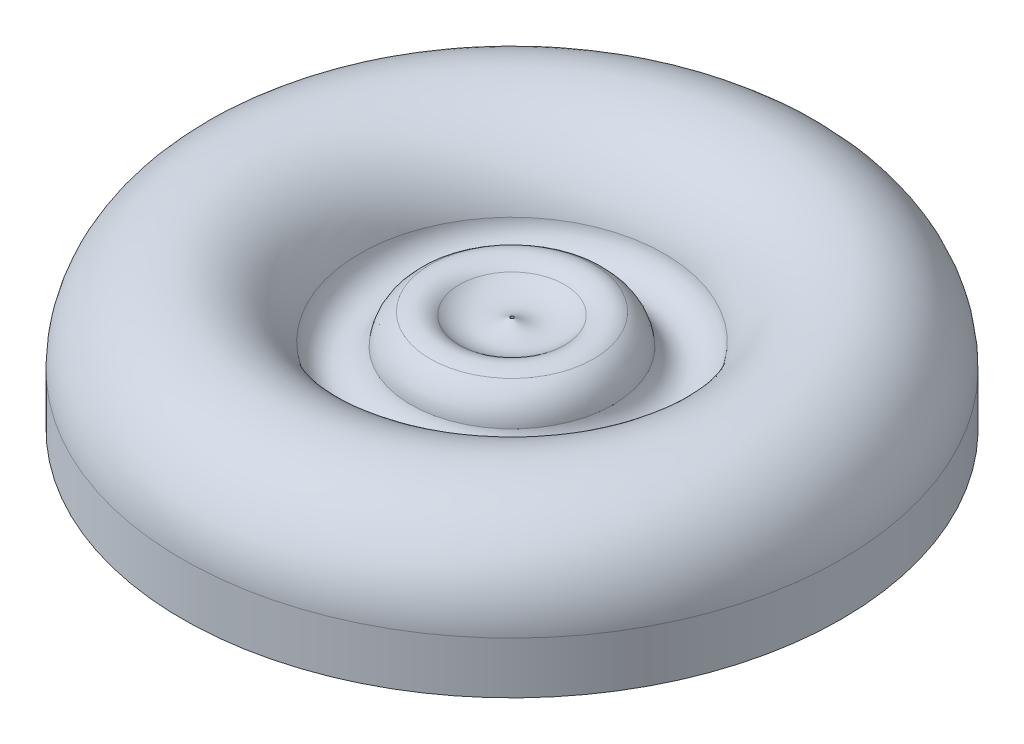
ISO-10303-21;
HEADER;
FILE_DESCRIPTION(('STEP AP214'),'2;1');
FILE_NAME('part.step','',(''),(''),'','','');
FILE_SCHEMA(('AUTOMOTIVE_DESIGN { 1 0 10303 214 1 1 1 1 }'));
ENDSEC;
DATA;
#1=APPLICATION_CONTEXT('core data for automotive mechanical design processes');
#2=APPLICATION_PROTOCOL_DEFINITION('international standard','automotive_design',2000,#1);
#3=PRODUCT_CONTEXT('',#1,'mechanical');
#4=PRODUCT('Part','Part','',(#3));
#5=PRODUCT_RELATED_PRODUCT_CATEGORY('part','',(#4));
#6=PRODUCT_DEFINITION_FORMATION('','',#4);
#7=PRODUCT_DEFINITION_CONTEXT('part definition',#1,'design');
#8=PRODUCT_DEFINITION('design','',#6,#7);
#9=PRODUCT_DEFINITION_SHAPE('','',#8);
#10=(LENGTH_UNIT() NAMED_UNIT(*) SI_UNIT(.MILLI.,.METRE.));
#11=(NAMED_UNIT(*) PLANE_ANGLE_UNIT() SI_UNIT($,.RADIAN.));
#12=(NAMED_UNIT(*) SI_UNIT($,.STERADIAN.) SOLID_ANGLE_UNIT());
#13=UNCERTAINTY_MEASURE_WITH_UNIT(LENGTH_MEASURE(1.E-05),#10,'distance_accuracy_value','');
#14=(GEOMETRIC_REPRESENTATION_CONTEXT(3) GLOBAL_UNCERTAINTY_ASSIGNED_CONTEXT((#13)) GLOBAL_UNIT_ASSIGNED_CONTEXT((#10,
#11,#12)) REPRESENTATION_CONTEXT('',''));
#15=CARTESIAN_POINT('',(0.,0.,0.));
#16=DIRECTION('',(0.,0.,1.));
#17=DIRECTION('',(1.,0.,0.));
#18=AXIS2_PLACEMENT_3D('',#15,#16,#17);
#19=CARTESIAN_POINT('',(0.228383109075024,3.76161050010545,0.));
#20=DIRECTION('',(0.,-1.,0.));
#21=DIRECTION('',(1.,0.,0.));
#22=AXIS2_PLACEMENT_3D('',#19,#20,#21);
#23=TOROIDAL_SURFACE('',#22,9.54385106769321,3.556);
#24=CARTESIAN_POINT('',(0.228383109075015,6.47788804937778,0.));
#25=DIRECTION('',(0.,-1.,0.));
#26=DIRECTION('',(1.,0.,0.));
#27=AXIS2_PLACEMENT_3D('',#24,#25,#26);
#28=CIRCLE('',#27,7.24886255458054);
#29=CARTESIAN_POINT('',(7.47724566365556,6.47788804937781,0.));
#30=VERTEX_POINT('',#29);
#31=EDGE_CURVE('E63',#30,#30,#28,.T.);
#32=ORIENTED_EDGE('',*,*,#31,.T.);
#33=EDGE_LOOP('',(#32));
#34=FACE_BOUND('',#33,.T.);
#35=CARTESIAN_POINT('',(0.228383109075013,6.86166444378286,0.));
#36=DIRECTION('',(0.,-1.,0.));
#37=DIRECTION('',(1.,0.,0.));
#38=AXIS2_PLACEMENT_3D('',#35,#36,#37);
#39=CIRCLE('',#38,11.285919248417);
#40=CARTESIAN_POINT('',(11.514302357492,6.8616644437829,0.));
#41=VERTEX_POINT('',#40);
#42=EDGE_CURVE('E10',#41,#41,#39,.T.);
#43=ORIENTED_EDGE('',*,*,#42,.F.);
#44=EDGE_LOOP('',(#43));
#45=FACE_BOUND('',#44,.T.);
#46=ADVANCED_FACE('F35',(#34,#45),#23,.T.);
#47=CARTESIAN_POINT('',(0.228383109075029,2.27801325563127,0.));
#48=DIRECTION('',(0.,-1.,0.));
#49=DIRECTION('',(1.,0.,0.));
#50=AXIS2_PLACEMENT_3D('',#47,#48,#49);
#51=TOROIDAL_SURFACE('',#50,8.71014700977542,5.2578);
#52=ORIENTED_EDGE('',*,*,#42,.T.);
#53=EDGE_LOOP('',(#52));
#54=FACE_BOUND('',#53,.T.);
#55=CARTESIAN_POINT('',(0.228383109075028,2.70346388154673,0.));
#56=DIRECTION('',(0.,-1.,0.));
#57=DIRECTION('',(1.,0.,0.));
#58=AXIS2_PLACEMENT_3D('',#55,#56,#57);
#59=CIRCLE('',#58,13.9507054346867);
#60=CARTESIAN_POINT('',(14.1790885437617,2.70346388154678,0.));
#61=VERTEX_POINT('',#60);
#62=EDGE_CURVE('E41',#61,#61,#59,.T.);
#63=ORIENTED_EDGE('',*,*,#62,.F.);
#64=EDGE_LOOP('',(#63));
#65=FACE_BOUND('',#64,.T.);
#66=ADVANCED_FACE('F101',(#54,#65),#51,.T.);
#67=CARTESIAN_POINT('',(0.228383109075025,3.79796180043673,0.));
#68=DIRECTION('',(0.,-1.,0.));
#69=DIRECTION('',(1.,0.,0.));
#70=AXIS2_PLACEMENT_3D('',#67,#68,#69);
#71=TOROIDAL_SURFACE('',#70,17.4169984024014,3.63498454363743);
#72=CARTESIAN_POINT('',(0.228383109075026,3.2886368192079,0.));
#73=DIRECTION('',(0.,-1.,0.));
#74=DIRECTION('',(1.,0.,0.));
#75=AXIS2_PLACEMENT_3D('',#72,#73,#74);
#76=CIRCLE('',#75,21.016123392726);
#77=CARTESIAN_POINT('',(21.244506501801,3.28863681920797,0.));
#78=VERTEX_POINT('',#77);
#79=EDGE_CURVE('E45',#78,#78,#76,.T.);
#80=ORIENTED_EDGE('',*,*,#79,.F.);
#81=EDGE_LOOP('',(#80));
#82=FACE_BOUND('',#81,.T.);
#83=ORIENTED_EDGE('',*,*,#62,.T.);
#84=EDGE_LOOP('',(#83));
#85=FACE_BOUND('',#84,.T.);
#86=ADVANCED_FACE('F96',(#82,#85),#71,.F.);
#87=CARTESIAN_POINT('',(0.228383109075039,-4.98799240273518E-07,0.));
#88=DIRECTION('',(0.,-1.,0.));
#89=DIRECTION('',(1.,0.,0.));
#90=AXIS2_PLACEMENT_3D('',#87,#88,#89);
#91=TOROIDAL_SURFACE('',#90,33.0197803601093,12.446);
#92=CARTESIAN_POINT('',(0.228383109075037,-4.98799162564068E-07,0.));
#93=DIRECTION('',(0.,-1.,0.));
#94=DIRECTION('',(1.,0.,0.));
#95=AXIS2_PLACEMENT_3D('',#92,#93,#94);
#96=CIRCLE('',#95,45.4657803601093);
#97=CARTESIAN_POINT('',(45.6941634691844,-4.98799003884521E-07,0.));
#98=VERTEX_POINT('',#97);
#99=EDGE_CURVE('E49',#98,#98,#96,.T.);
#100=ORIENTED_EDGE('',*,*,#99,.F.);
#101=EDGE_LOOP('',(#100));
#102=FACE_BOUND('',#101,.T.);
#103=ORIENTED_EDGE('',*,*,#79,.T.);
#104=EDGE_LOOP('',(#103));
#105=FACE_BOUND('',#104,.T.);
#106=ADVANCED_FACE('F90',(#102,#105),#91,.T.);
#107=CARTESIAN_POINT('',(0.228383109075039,-0.616910329203168,0.));
#108=DIRECTION('',(0.,-1.,0.));
#109=DIRECTION('',(1.,0.,0.));
#110=AXIS2_PLACEMENT_3D('',#107,#108,#109);
#111=CYLINDRICAL_SURFACE('',#110,45.4657803601094);
#112=CARTESIAN_POINT('',(0.228383109075062,-7.13740049879916,0.));
#113=DIRECTION('',(0.,-1.,0.));
#114=DIRECTION('',(1.,0.,0.));
#115=AXIS2_PLACEMENT_3D('',#112,#113,#114);
#116=CIRCLE('',#115,45.4657803601094);
#117=CARTESIAN_POINT('',(45.6941634691844,-7.137400498799,0.));
#118=VERTEX_POINT('',#117);
#119=EDGE_CURVE('E54',#118,#118,#116,.T.);
#120=ORIENTED_EDGE('',*,*,#119,.F.);
#121=EDGE_LOOP('',(#120));
#122=FACE_BOUND('',#121,.T.);
#123=ORIENTED_EDGE('',*,*,#99,.T.);
#124=EDGE_LOOP('',(#123));
#125=FACE_BOUND('',#124,.T.);
#126=ADVANCED_FACE('F84',(#122,#125),#111,.T.);
#127=CARTESIAN_POINT('',(-23.6670338804199,-7.13740049879932,0.));
#128=DIRECTION('',(0.,1.,0.));
#129=DIRECTION('',(-1.,0.,0.));
#130=AXIS2_PLACEMENT_3D('',#127,#128,#129);
#131=PLANE('',#130);
#132=CARTESIAN_POINT('',(0.228383109075062,-7.13740049879931,0.));
#133=DIRECTION('',(0.,-1.,0.));
#134=DIRECTION('',(1.,0.,0.));
#135=AXIS2_PLACEMENT_3D('',#132,#133,#134);
#136=CIRCLE('',#135,0.228383109075062);
#137=CARTESIAN_POINT('',(0.456766218150124,-7.13740049879931,0.));
#138=VERTEX_POINT('',#137);
#139=EDGE_CURVE('E57',#138,#138,#136,.T.);
#140=ORIENTED_EDGE('',*,*,#139,.F.);
#141=EDGE_LOOP('',(#140));
#142=FACE_BOUND('',#141,.T.);
#143=ORIENTED_EDGE('',*,*,#119,.T.);
#144=EDGE_LOOP('',(#143));
#145=FACE_BOUND('',#144,.T.);
#146=ADVANCED_FACE('F78',(#142,#145),#131,.F.);
#147=CARTESIAN_POINT('',(0.228383109075039,-0.616910329203168,0.));
#148=DIRECTION('',(0.,-1.,0.));
#149=DIRECTION('',(1.,0.,0.));
#150=AXIS2_PLACEMENT_3D('',#147,#148,#149);
#151=CYLINDRICAL_SURFACE('',#150,0.228383109075039);
#152=CARTESIAN_POINT('',(0.228383109075016,6.17778748924611,0.));
#153=DIRECTION('',(0.,-1.,0.));
#154=DIRECTION('',(1.,0.,0.));
#155=AXIS2_PLACEMENT_3D('',#152,#153,#154);
#156=CIRCLE('',#155,0.228383109075016);
#157=CARTESIAN_POINT('',(0.456766218150031,6.17778748924612,0.));
#158=VERTEX_POINT('',#157);
#159=EDGE_CURVE('E60',#158,#158,#156,.T.);
#160=ORIENTED_EDGE('',*,*,#159,.F.);
#161=EDGE_LOOP('',(#160));
#162=FACE_BOUND('',#161,.T.);
#163=ORIENTED_EDGE('',*,*,#139,.T.);
#164=EDGE_LOOP('',(#163));
#165=FACE_BOUND('',#164,.T.);
#166=ADVANCED_FACE('F72',(#162,#165),#151,.F.);
#167=CARTESIAN_POINT('',(0.228383109074999,10.8618925503318,0.));
#168=DIRECTION('',(0.,-1.,0.));
#169=DIRECTION('',(1.,0.,0.));
#170=AXIS2_PLACEMENT_3D('',#167,#168,#169);
#171=DEGENERATE_TOROIDAL_SURFACE('',#170,3.54480809452763,5.73929568043181,.T.);
#172=ORIENTED_EDGE('',*,*,#31,.F.);
#173=EDGE_LOOP('',(#172));
#174=FACE_BOUND('',#173,.T.);
#175=ORIENTED_EDGE('',*,*,#159,.T.);
#176=EDGE_LOOP('',(#175));
#177=FACE_BOUND('',#176,.T.);
#178=ADVANCED_FACE('F69',(#174,#177),#171,.F.);
#179=CLOSED_SHELL('',(#46,#66,#86,#106,#126,#146,#166,#178));
#180=MANIFOLD_SOLID_BREP('B2',#179);
#181=ADVANCED_BREP_SHAPE_REPRESENTATION('',(#18,#180),#14);
#182=SHAPE_DEFINITION_REPRESENTATION(#9,#181);
ENDSEC;
END-ISO-10303-21;
